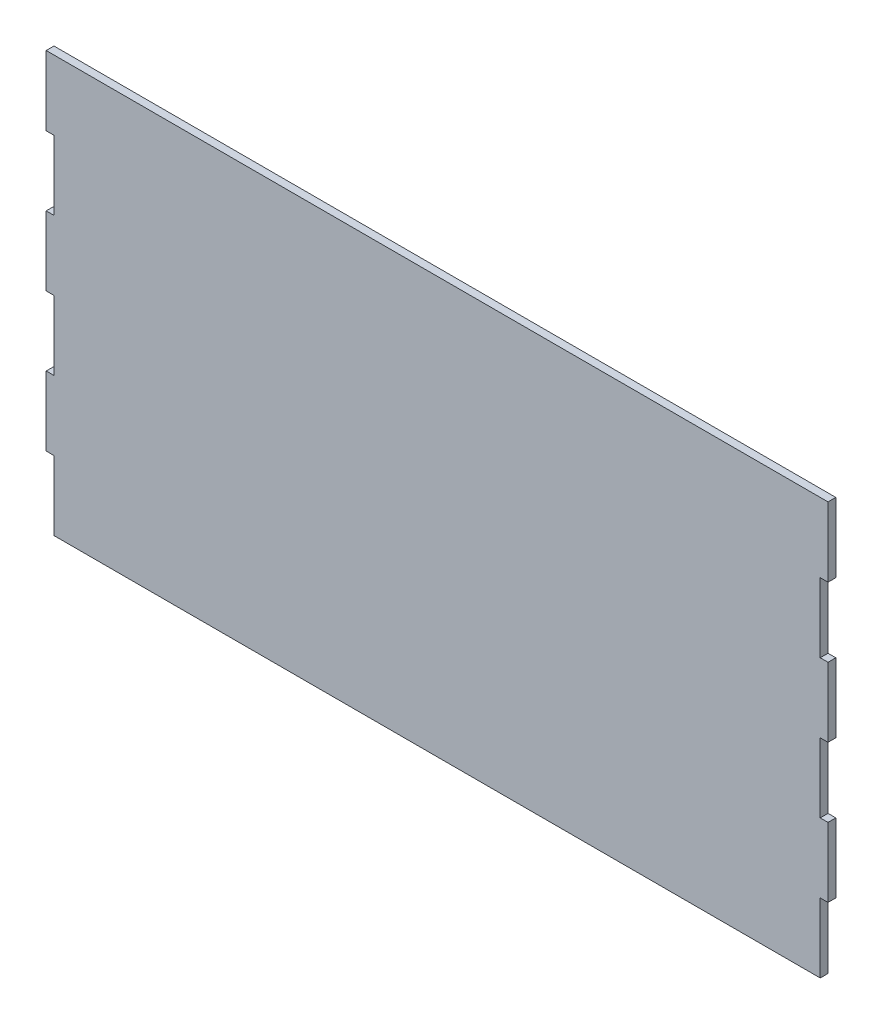
ISO-10303-21;
HEADER;
FILE_DESCRIPTION(('STEP AP214'),'2;1');
FILE_NAME('part.step','',(''),(''),'','','');
FILE_SCHEMA(('AUTOMOTIVE_DESIGN { 1 0 10303 214 1 1 1 1 }'));
ENDSEC;
DATA;
#1=APPLICATION_CONTEXT('core data for automotive mechanical design processes');
#2=APPLICATION_PROTOCOL_DEFINITION('international standard','automotive_design',2000,#1);
#3=PRODUCT_CONTEXT('',#1,'mechanical');
#4=PRODUCT('Part','Part','',(#3));
#5=PRODUCT_RELATED_PRODUCT_CATEGORY('part','',(#4));
#6=PRODUCT_DEFINITION_FORMATION('','',#4);
#7=PRODUCT_DEFINITION_CONTEXT('part definition',#1,'design');
#8=PRODUCT_DEFINITION('design','',#6,#7);
#9=PRODUCT_DEFINITION_SHAPE('','',#8);
#10=(LENGTH_UNIT() NAMED_UNIT(*) SI_UNIT(.MILLI.,.METRE.));
#11=(NAMED_UNIT(*) PLANE_ANGLE_UNIT() SI_UNIT($,.RADIAN.));
#12=(NAMED_UNIT(*) SI_UNIT($,.STERADIAN.) SOLID_ANGLE_UNIT());
#13=UNCERTAINTY_MEASURE_WITH_UNIT(LENGTH_MEASURE(1.E-05),#10,'distance_accuracy_value','');
#14=(GEOMETRIC_REPRESENTATION_CONTEXT(3) GLOBAL_UNCERTAINTY_ASSIGNED_CONTEXT((#13)) GLOBAL_UNIT_ASSIGNED_CONTEXT((#10,
#11,#12)) REPRESENTATION_CONTEXT('',''));
#15=CARTESIAN_POINT('',(0.,0.,0.));
#16=DIRECTION('',(0.,0.,1.));
#17=DIRECTION('',(1.,0.,0.));
#18=AXIS2_PLACEMENT_3D('',#15,#16,#17);
#19=CARTESIAN_POINT('',(-147.537163876748,3.44279027216279,3.));
#20=DIRECTION('',(1.,0.,0.));
#21=DIRECTION('',(0.,1.,0.));
#22=AXIS2_PLACEMENT_3D('',#19,#20,#21);
#23=PLANE('',#22);
#24=DIRECTION('',(0.,-1.,0.));
#25=VECTOR('',#24,1.);
#26=CARTESIAN_POINT('',(-147.537163876748,3.44279027216279,0.));
#27=LINE('',#26,#25);
#28=CARTESIAN_POINT('',(-147.537163876748,3.44279027216279,0.));
#29=VERTEX_POINT('',#28);
#30=CARTESIAN_POINT('',(-147.537163876748,-23.2572097278367,0.));
#31=VERTEX_POINT('',#30);
#32=EDGE_CURVE('E233',#29,#31,#27,.T.);
#33=ORIENTED_EDGE('',*,*,#32,.T.);
#34=DIRECTION('',(0.,0.,-1.));
#35=VECTOR('',#34,1.);
#36=CARTESIAN_POINT('',(-147.537163876748,-23.2572097278367,3.));
#37=LINE('',#36,#35);
#38=CARTESIAN_POINT('',(-147.537163876748,-23.2572097278367,3.));
#39=VERTEX_POINT('',#38);
#40=EDGE_CURVE('E11',#39,#31,#37,.T.);
#41=ORIENTED_EDGE('',*,*,#40,.F.);
#42=DIRECTION('',(0.,-1.,0.));
#43=VECTOR('',#42,1.);
#44=CARTESIAN_POINT('',(-147.537163876748,3.44279027216279,3.));
#45=LINE('',#44,#43);
#46=CARTESIAN_POINT('',(-147.537163876748,3.44279027216279,3.));
#47=VERTEX_POINT('',#46);
#48=EDGE_CURVE('E280',#47,#39,#45,.T.);
#49=ORIENTED_EDGE('',*,*,#48,.F.);
#50=DIRECTION('',(0.,0.,-1.));
#51=VECTOR('',#50,1.);
#52=CARTESIAN_POINT('',(-147.537163876748,3.44279027216279,3.));
#53=LINE('',#52,#51);
#54=EDGE_CURVE('E229',#47,#29,#53,.T.);
#55=ORIENTED_EDGE('',*,*,#54,.T.);
#56=EDGE_LOOP('',(#33,#41,#49,#55));
#57=FACE_BOUND('',#56,.T.);
#58=ADVANCED_FACE('F41',(#57),#23,.F.);
#59=CARTESIAN_POINT('',(-147.537163876748,-23.2572097278367,3.));
#60=DIRECTION('',(0.,1.,0.));
#61=DIRECTION('',(0.,0.,1.));
#62=AXIS2_PLACEMENT_3D('',#59,#60,#61);
#63=PLANE('',#62);
#64=DIRECTION('',(1.,0.,0.));
#65=VECTOR('',#64,1.);
#66=CARTESIAN_POINT('',(-147.537163876748,-23.2572097278367,0.));
#67=LINE('',#66,#65);
#68=CARTESIAN_POINT('',(147.537163876748,-23.2572097278367,0.));
#69=VERTEX_POINT('',#68);
#70=EDGE_CURVE('E236',#31,#69,#67,.T.);
#71=ORIENTED_EDGE('',*,*,#70,.T.);
#72=DIRECTION('',(0.,0.,-1.));
#73=VECTOR('',#72,1.);
#74=CARTESIAN_POINT('',(147.537163876748,-23.2572097278367,3.));
#75=LINE('',#74,#73);
#76=CARTESIAN_POINT('',(147.537163876748,-23.2572097278367,3.));
#77=VERTEX_POINT('',#76);
#78=EDGE_CURVE('E49',#77,#69,#75,.T.);
#79=ORIENTED_EDGE('',*,*,#78,.F.);
#80=DIRECTION('',(1.,0.,0.));
#81=VECTOR('',#80,1.);
#82=CARTESIAN_POINT('',(-147.537163876748,-23.2572097278367,3.));
#83=LINE('',#82,#81);
#84=EDGE_CURVE('E148',#39,#77,#83,.T.);
#85=ORIENTED_EDGE('',*,*,#84,.F.);
#86=ORIENTED_EDGE('',*,*,#40,.T.);
#87=EDGE_LOOP('',(#71,#79,#85,#86));
#88=FACE_BOUND('',#87,.T.);
#89=ADVANCED_FACE('F418',(#88),#63,.F.);
#90=CARTESIAN_POINT('',(147.537163876748,3.44279027216279,3.));
#91=DIRECTION('',(-1.,0.,0.));
#92=DIRECTION('',(0.,-1.,0.));
#93=AXIS2_PLACEMENT_3D('',#90,#91,#92);
#94=PLANE('',#93);
#95=DIRECTION('',(0.,1.,0.));
#96=VECTOR('',#95,1.);
#97=CARTESIAN_POINT('',(147.537163876748,3.44279027216279,0.));
#98=LINE('',#97,#96);
#99=CARTESIAN_POINT('',(147.537163876748,3.44279027216279,0.));
#100=VERTEX_POINT('',#99);
#101=EDGE_CURVE('E238',#69,#100,#98,.T.);
#102=ORIENTED_EDGE('',*,*,#101,.T.);
#103=DIRECTION('',(0.,0.,-1.));
#104=VECTOR('',#103,1.);
#105=CARTESIAN_POINT('',(147.537163876748,3.44279027216279,3.));
#106=LINE('',#105,#104);
#107=CARTESIAN_POINT('',(147.537163876748,3.44279027216279,3.));
#108=VERTEX_POINT('',#107);
#109=EDGE_CURVE('E335',#108,#100,#106,.T.);
#110=ORIENTED_EDGE('',*,*,#109,.F.);
#111=DIRECTION('',(0.,1.,0.));
#112=VECTOR('',#111,1.);
#113=CARTESIAN_POINT('',(147.537163876748,3.44279027216279,3.));
#114=LINE('',#113,#112);
#115=EDGE_CURVE('E343',#77,#108,#114,.T.);
#116=ORIENTED_EDGE('',*,*,#115,.F.);
#117=ORIENTED_EDGE('',*,*,#78,.T.);
#118=EDGE_LOOP('',(#102,#110,#116,#117));
#119=FACE_BOUND('',#118,.T.);
#120=ADVANCED_FACE('F341',(#119),#94,.F.);
#121=CARTESIAN_POINT('',(150.537163876748,3.44279027216279,3.));
#122=DIRECTION('',(0.,1.,0.));
#123=DIRECTION('',(0.,0.,1.));
#124=AXIS2_PLACEMENT_3D('',#121,#122,#123);
#125=PLANE('',#124);
#126=DIRECTION('',(1.,0.,0.));
#127=VECTOR('',#126,1.);
#128=CARTESIAN_POINT('',(150.537163876748,3.44279027216279,0.));
#129=LINE('',#128,#127);
#130=CARTESIAN_POINT('',(150.537163876748,3.44279027216279,0.));
#131=VERTEX_POINT('',#130);
#132=EDGE_CURVE('E240',#100,#131,#129,.T.);
#133=ORIENTED_EDGE('',*,*,#132,.T.);
#134=DIRECTION('',(0.,0.,-1.));
#135=VECTOR('',#134,1.);
#136=CARTESIAN_POINT('',(150.537163876748,3.44279027216279,3.));
#137=LINE('',#136,#135);
#138=CARTESIAN_POINT('',(150.537163876748,3.44279027216279,3.));
#139=VERTEX_POINT('',#138);
#140=EDGE_CURVE('E332',#139,#131,#137,.T.);
#141=ORIENTED_EDGE('',*,*,#140,.F.);
#142=DIRECTION('',(1.,0.,0.));
#143=VECTOR('',#142,1.);
#144=CARTESIAN_POINT('',(150.537163876748,3.44279027216279,3.));
#145=LINE('',#144,#143);
#146=EDGE_CURVE('E361',#108,#139,#145,.T.);
#147=ORIENTED_EDGE('',*,*,#146,.F.);
#148=ORIENTED_EDGE('',*,*,#109,.T.);
#149=EDGE_LOOP('',(#133,#141,#147,#148));
#150=FACE_BOUND('',#149,.T.);
#151=ADVANCED_FACE('F352',(#150),#125,.F.);
#152=CARTESIAN_POINT('',(150.537163876748,30.1427902721628,3.));
#153=DIRECTION('',(-1.,0.,0.));
#154=DIRECTION('',(0.,0.,1.));
#155=AXIS2_PLACEMENT_3D('',#152,#153,#154);
#156=PLANE('',#155);
#157=DIRECTION('',(0.,1.,0.));
#158=VECTOR('',#157,1.);
#159=CARTESIAN_POINT('',(150.537163876748,30.1427902721628,0.));
#160=LINE('',#159,#158);
#161=CARTESIAN_POINT('',(150.537163876748,30.1427902721628,0.));
#162=VERTEX_POINT('',#161);
#163=EDGE_CURVE('E242',#131,#162,#160,.T.);
#164=ORIENTED_EDGE('',*,*,#163,.T.);
#165=DIRECTION('',(0.,0.,-1.));
#166=VECTOR('',#165,1.);
#167=CARTESIAN_POINT('',(150.537163876748,30.1427902721628,3.));
#168=LINE('',#167,#166);
#169=CARTESIAN_POINT('',(150.537163876748,30.1427902721628,3.));
#170=VERTEX_POINT('',#169);
#171=EDGE_CURVE('E329',#170,#162,#168,.T.);
#172=ORIENTED_EDGE('',*,*,#171,.F.);
#173=DIRECTION('',(0.,1.,0.));
#174=VECTOR('',#173,1.);
#175=CARTESIAN_POINT('',(150.537163876748,30.1427902721628,3.));
#176=LINE('',#175,#174);
#177=EDGE_CURVE('E358',#139,#170,#176,.T.);
#178=ORIENTED_EDGE('',*,*,#177,.F.);
#179=ORIENTED_EDGE('',*,*,#140,.T.);
#180=EDGE_LOOP('',(#164,#172,#178,#179));
#181=FACE_BOUND('',#180,.T.);
#182=ADVANCED_FACE('F356',(#181),#156,.F.);
#183=CARTESIAN_POINT('',(147.537163876748,30.1427902721628,3.));
#184=DIRECTION('',(0.,-1.,0.));
#185=DIRECTION('',(0.,0.,-1.));
#186=AXIS2_PLACEMENT_3D('',#183,#184,#185);
#187=PLANE('',#186);
#188=DIRECTION('',(-1.,0.,0.));
#189=VECTOR('',#188,1.);
#190=CARTESIAN_POINT('',(147.537163876748,30.1427902721628,0.));
#191=LINE('',#190,#189);
#192=CARTESIAN_POINT('',(147.537163876748,30.1427902721628,0.));
#193=VERTEX_POINT('',#192);
#194=EDGE_CURVE('E244',#162,#193,#191,.T.);
#195=ORIENTED_EDGE('',*,*,#194,.T.);
#196=DIRECTION('',(0.,0.,-1.));
#197=VECTOR('',#196,1.);
#198=CARTESIAN_POINT('',(147.537163876748,30.1427902721628,3.));
#199=LINE('',#198,#197);
#200=CARTESIAN_POINT('',(147.537163876748,30.1427902721628,3.));
#201=VERTEX_POINT('',#200);
#202=EDGE_CURVE('E326',#201,#193,#199,.T.);
#203=ORIENTED_EDGE('',*,*,#202,.F.);
#204=DIRECTION('',(-1.,0.,0.));
#205=VECTOR('',#204,1.);
#206=CARTESIAN_POINT('',(147.537163876748,30.1427902721628,3.));
#207=LINE('',#206,#205);
#208=EDGE_CURVE('E360',#170,#201,#207,.T.);
#209=ORIENTED_EDGE('',*,*,#208,.F.);
#210=ORIENTED_EDGE('',*,*,#171,.T.);
#211=EDGE_LOOP('',(#195,#203,#209,#210));
#212=FACE_BOUND('',#211,.T.);
#213=ADVANCED_FACE('F431',(#212),#187,.F.);
#214=CARTESIAN_POINT('',(147.537163876748,56.8427902721628,3.));
#215=DIRECTION('',(-1.,0.,0.));
#216=DIRECTION('',(0.,0.,1.));
#217=AXIS2_PLACEMENT_3D('',#214,#215,#216);
#218=PLANE('',#217);
#219=DIRECTION('',(0.,1.,0.));
#220=VECTOR('',#219,1.);
#221=CARTESIAN_POINT('',(147.537163876748,56.8427902721628,0.));
#222=LINE('',#221,#220);
#223=CARTESIAN_POINT('',(147.537163876748,56.8427902721628,0.));
#224=VERTEX_POINT('',#223);
#225=EDGE_CURVE('E246',#193,#224,#222,.T.);
#226=ORIENTED_EDGE('',*,*,#225,.T.);
#227=DIRECTION('',(0.,0.,-1.));
#228=VECTOR('',#227,1.);
#229=CARTESIAN_POINT('',(147.537163876748,56.8427902721628,3.));
#230=LINE('',#229,#228);
#231=CARTESIAN_POINT('',(147.537163876748,56.8427902721628,3.));
#232=VERTEX_POINT('',#231);
#233=EDGE_CURVE('E323',#232,#224,#230,.T.);
#234=ORIENTED_EDGE('',*,*,#233,.F.);
#235=DIRECTION('',(0.,1.,0.));
#236=VECTOR('',#235,1.);
#237=CARTESIAN_POINT('',(147.537163876748,56.8427902721628,3.));
#238=LINE('',#237,#236);
#239=EDGE_CURVE('E363',#201,#232,#238,.T.);
#240=ORIENTED_EDGE('',*,*,#239,.F.);
#241=ORIENTED_EDGE('',*,*,#202,.T.);
#242=EDGE_LOOP('',(#226,#234,#240,#241));
#243=FACE_BOUND('',#242,.T.);
#244=ADVANCED_FACE('F434',(#243),#218,.F.);
#245=CARTESIAN_POINT('',(150.537163876748,56.8427902721628,3.));
#246=DIRECTION('',(0.,1.,0.));
#247=DIRECTION('',(0.,0.,1.));
#248=AXIS2_PLACEMENT_3D('',#245,#246,#247);
#249=PLANE('',#248);
#250=DIRECTION('',(1.,0.,0.));
#251=VECTOR('',#250,1.);
#252=CARTESIAN_POINT('',(150.537163876748,56.8427902721628,0.));
#253=LINE('',#252,#251);
#254=CARTESIAN_POINT('',(150.537163876748,56.8427902721628,0.));
#255=VERTEX_POINT('',#254);
#256=EDGE_CURVE('E248',#224,#255,#253,.T.);
#257=ORIENTED_EDGE('',*,*,#256,.T.);
#258=DIRECTION('',(0.,0.,-1.));
#259=VECTOR('',#258,1.);
#260=CARTESIAN_POINT('',(150.537163876748,56.8427902721628,3.));
#261=LINE('',#260,#259);
#262=CARTESIAN_POINT('',(150.537163876748,56.8427902721628,3.));
#263=VERTEX_POINT('',#262);
#264=EDGE_CURVE('E320',#263,#255,#261,.T.);
#265=ORIENTED_EDGE('',*,*,#264,.F.);
#266=DIRECTION('',(1.,0.,0.));
#267=VECTOR('',#266,1.);
#268=CARTESIAN_POINT('',(150.537163876748,56.8427902721628,3.));
#269=LINE('',#268,#267);
#270=EDGE_CURVE('E369',#232,#263,#269,.T.);
#271=ORIENTED_EDGE('',*,*,#270,.F.);
#272=ORIENTED_EDGE('',*,*,#233,.T.);
#273=EDGE_LOOP('',(#257,#265,#271,#272));
#274=FACE_BOUND('',#273,.T.);
#275=ADVANCED_FACE('F438',(#274),#249,.F.);
#276=CARTESIAN_POINT('',(150.537163876748,83.5427902721628,3.));
#277=DIRECTION('',(-1.,0.,0.));
#278=DIRECTION('',(0.,0.,1.));
#279=AXIS2_PLACEMENT_3D('',#276,#277,#278);
#280=PLANE('',#279);
#281=DIRECTION('',(0.,1.,0.));
#282=VECTOR('',#281,1.);
#283=CARTESIAN_POINT('',(150.537163876748,83.5427902721628,0.));
#284=LINE('',#283,#282);
#285=CARTESIAN_POINT('',(150.537163876748,83.5427902721628,0.));
#286=VERTEX_POINT('',#285);
#287=EDGE_CURVE('E250',#255,#286,#284,.T.);
#288=ORIENTED_EDGE('',*,*,#287,.T.);
#289=DIRECTION('',(0.,0.,-1.));
#290=VECTOR('',#289,1.);
#291=CARTESIAN_POINT('',(150.537163876748,83.5427902721628,3.));
#292=LINE('',#291,#290);
#293=CARTESIAN_POINT('',(150.537163876748,83.5427902721628,3.));
#294=VERTEX_POINT('',#293);
#295=EDGE_CURVE('E317',#294,#286,#292,.T.);
#296=ORIENTED_EDGE('',*,*,#295,.F.);
#297=DIRECTION('',(0.,1.,0.));
#298=VECTOR('',#297,1.);
#299=CARTESIAN_POINT('',(150.537163876748,83.5427902721628,3.));
#300=LINE('',#299,#298);
#301=EDGE_CURVE('E371',#263,#294,#300,.T.);
#302=ORIENTED_EDGE('',*,*,#301,.F.);
#303=ORIENTED_EDGE('',*,*,#264,.T.);
#304=EDGE_LOOP('',(#288,#296,#302,#303));
#305=FACE_BOUND('',#304,.T.);
#306=ADVANCED_FACE('F442',(#305),#280,.F.);
#307=CARTESIAN_POINT('',(147.537163876748,83.5427902721628,3.));
#308=DIRECTION('',(0.,-1.,0.));
#309=DIRECTION('',(0.,0.,-1.));
#310=AXIS2_PLACEMENT_3D('',#307,#308,#309);
#311=PLANE('',#310);
#312=DIRECTION('',(-1.,0.,0.));
#313=VECTOR('',#312,1.);
#314=CARTESIAN_POINT('',(147.537163876748,83.5427902721628,0.));
#315=LINE('',#314,#313);
#316=CARTESIAN_POINT('',(147.537163876748,83.5427902721628,0.));
#317=VERTEX_POINT('',#316);
#318=EDGE_CURVE('E252',#286,#317,#315,.T.);
#319=ORIENTED_EDGE('',*,*,#318,.T.);
#320=DIRECTION('',(0.,0.,-1.));
#321=VECTOR('',#320,1.);
#322=CARTESIAN_POINT('',(147.537163876748,83.5427902721628,3.));
#323=LINE('',#322,#321);
#324=CARTESIAN_POINT('',(147.537163876748,83.5427902721628,3.));
#325=VERTEX_POINT('',#324);
#326=EDGE_CURVE('E314',#325,#317,#323,.T.);
#327=ORIENTED_EDGE('',*,*,#326,.F.);
#328=DIRECTION('',(-1.,0.,0.));
#329=VECTOR('',#328,1.);
#330=CARTESIAN_POINT('',(147.537163876748,83.5427902721628,3.));
#331=LINE('',#330,#329);
#332=EDGE_CURVE('E373',#294,#325,#331,.T.);
#333=ORIENTED_EDGE('',*,*,#332,.F.);
#334=ORIENTED_EDGE('',*,*,#295,.T.);
#335=EDGE_LOOP('',(#319,#327,#333,#334));
#336=FACE_BOUND('',#335,.T.);
#337=ADVANCED_FACE('F446',(#336),#311,.F.);
#338=CARTESIAN_POINT('',(147.537163876748,110.242790272163,3.));
#339=DIRECTION('',(-1.,0.,0.));
#340=DIRECTION('',(0.,0.,1.));
#341=AXIS2_PLACEMENT_3D('',#338,#339,#340);
#342=PLANE('',#341);
#343=DIRECTION('',(0.,1.,0.));
#344=VECTOR('',#343,1.);
#345=CARTESIAN_POINT('',(147.537163876748,110.242790272163,0.));
#346=LINE('',#345,#344);
#347=CARTESIAN_POINT('',(147.537163876748,110.242790272163,0.));
#348=VERTEX_POINT('',#347);
#349=EDGE_CURVE('E254',#317,#348,#346,.T.);
#350=ORIENTED_EDGE('',*,*,#349,.T.);
#351=DIRECTION('',(0.,0.,-1.));
#352=VECTOR('',#351,1.);
#353=CARTESIAN_POINT('',(147.537163876748,110.242790272163,3.));
#354=LINE('',#353,#352);
#355=CARTESIAN_POINT('',(147.537163876748,110.242790272163,3.));
#356=VERTEX_POINT('',#355);
#357=EDGE_CURVE('E311',#356,#348,#354,.T.);
#358=ORIENTED_EDGE('',*,*,#357,.F.);
#359=DIRECTION('',(0.,1.,0.));
#360=VECTOR('',#359,1.);
#361=CARTESIAN_POINT('',(147.537163876748,110.242790272163,3.));
#362=LINE('',#361,#360);
#363=EDGE_CURVE('E375',#325,#356,#362,.T.);
#364=ORIENTED_EDGE('',*,*,#363,.F.);
#365=ORIENTED_EDGE('',*,*,#326,.T.);
#366=EDGE_LOOP('',(#350,#358,#364,#365));
#367=FACE_BOUND('',#366,.T.);
#368=ADVANCED_FACE('F450',(#367),#342,.F.);
#369=CARTESIAN_POINT('',(150.537163876748,110.242790272163,3.));
#370=DIRECTION('',(0.,1.,0.));
#371=DIRECTION('',(-1.,0.,0.));
#372=AXIS2_PLACEMENT_3D('',#369,#370,#371);
#373=PLANE('',#372);
#374=DIRECTION('',(1.,0.,0.));
#375=VECTOR('',#374,1.);
#376=CARTESIAN_POINT('',(150.537163876748,110.242790272163,0.));
#377=LINE('',#376,#375);
#378=CARTESIAN_POINT('',(150.537163876748,110.242790272163,0.));
#379=VERTEX_POINT('',#378);
#380=EDGE_CURVE('E256',#348,#379,#377,.T.);
#381=ORIENTED_EDGE('',*,*,#380,.T.);
#382=DIRECTION('',(0.,0.,-1.));
#383=VECTOR('',#382,1.);
#384=CARTESIAN_POINT('',(150.537163876748,110.242790272163,3.));
#385=LINE('',#384,#383);
#386=CARTESIAN_POINT('',(150.537163876748,110.242790272163,3.));
#387=VERTEX_POINT('',#386);
#388=EDGE_CURVE('E308',#387,#379,#385,.T.);
#389=ORIENTED_EDGE('',*,*,#388,.F.);
#390=DIRECTION('',(1.,0.,0.));
#391=VECTOR('',#390,1.);
#392=CARTESIAN_POINT('',(150.537163876748,110.242790272163,3.));
#393=LINE('',#392,#391);
#394=EDGE_CURVE('E377',#356,#387,#393,.T.);
#395=ORIENTED_EDGE('',*,*,#394,.F.);
#396=ORIENTED_EDGE('',*,*,#357,.T.);
#397=EDGE_LOOP('',(#381,#389,#395,#396));
#398=FACE_BOUND('',#397,.T.);
#399=ADVANCED_FACE('F454',(#398),#373,.F.);
#400=CARTESIAN_POINT('',(150.537163876748,137.021276107109,3.));
#401=DIRECTION('',(-1.,0.,0.));
#402=DIRECTION('',(0.,-1.,0.));
#403=AXIS2_PLACEMENT_3D('',#400,#401,#402);
#404=PLANE('',#403);
#405=DIRECTION('',(0.,1.,0.));
#406=VECTOR('',#405,1.);
#407=CARTESIAN_POINT('',(150.537163876748,137.021276107109,0.));
#408=LINE('',#407,#406);
#409=CARTESIAN_POINT('',(150.537163876748,137.021276107109,0.));
#410=VERTEX_POINT('',#409);
#411=EDGE_CURVE('E258',#379,#410,#408,.T.);
#412=ORIENTED_EDGE('',*,*,#411,.T.);
#413=DIRECTION('',(0.,0.,-1.));
#414=VECTOR('',#413,1.);
#415=CARTESIAN_POINT('',(150.537163876748,137.021276107109,3.));
#416=LINE('',#415,#414);
#417=CARTESIAN_POINT('',(150.537163876748,137.021276107109,3.));
#418=VERTEX_POINT('',#417);
#419=EDGE_CURVE('E305',#418,#410,#416,.T.);
#420=ORIENTED_EDGE('',*,*,#419,.F.);
#421=DIRECTION('',(0.,1.,0.));
#422=VECTOR('',#421,1.);
#423=CARTESIAN_POINT('',(150.537163876748,137.021276107109,3.));
#424=LINE('',#423,#422);
#425=EDGE_CURVE('E379',#387,#418,#424,.T.);
#426=ORIENTED_EDGE('',*,*,#425,.F.);
#427=ORIENTED_EDGE('',*,*,#388,.T.);
#428=EDGE_LOOP('',(#412,#420,#426,#427));
#429=FACE_BOUND('',#428,.T.);
#430=ADVANCED_FACE('F458',(#429),#404,.F.);
#431=CARTESIAN_POINT('',(-150.537163876748,137.021276107109,3.));
#432=DIRECTION('',(0.,-1.,0.));
#433=DIRECTION('',(0.,0.,-1.));
#434=AXIS2_PLACEMENT_3D('',#431,#432,#433);
#435=PLANE('',#434);
#436=DIRECTION('',(-1.,0.,0.));
#437=VECTOR('',#436,1.);
#438=CARTESIAN_POINT('',(-150.537163876748,137.021276107109,0.));
#439=LINE('',#438,#437);
#440=CARTESIAN_POINT('',(-150.537163876748,137.021276107109,0.));
#441=VERTEX_POINT('',#440);
#442=EDGE_CURVE('E261',#410,#441,#439,.T.);
#443=ORIENTED_EDGE('',*,*,#442,.T.);
#444=DIRECTION('',(0.,0.,-1.));
#445=VECTOR('',#444,1.);
#446=CARTESIAN_POINT('',(-150.537163876748,137.021276107109,3.));
#447=LINE('',#446,#445);
#448=CARTESIAN_POINT('',(-150.537163876748,137.021276107109,3.));
#449=VERTEX_POINT('',#448);
#450=EDGE_CURVE('E302',#449,#441,#447,.T.);
#451=ORIENTED_EDGE('',*,*,#450,.F.);
#452=DIRECTION('',(-1.,0.,0.));
#453=VECTOR('',#452,1.);
#454=CARTESIAN_POINT('',(150.537163876748,137.021276107109,3.));
#455=LINE('',#454,#453);
#456=EDGE_CURVE('E381',#418,#449,#455,.T.);
#457=ORIENTED_EDGE('',*,*,#456,.F.);
#458=ORIENTED_EDGE('',*,*,#419,.T.);
#459=EDGE_LOOP('',(#443,#451,#457,#458));
#460=FACE_BOUND('',#459,.T.);
#461=ADVANCED_FACE('F462',(#460),#435,.F.);
#462=CARTESIAN_POINT('',(-150.537163876748,137.021276107109,3.));
#463=DIRECTION('',(1.,0.,0.));
#464=DIRECTION('',(0.,1.,0.));
#465=AXIS2_PLACEMENT_3D('',#462,#463,#464);
#466=PLANE('',#465);
#467=DIRECTION('',(0.,-1.,0.));
#468=VECTOR('',#467,1.);
#469=CARTESIAN_POINT('',(-150.537163876748,137.021276107109,0.));
#470=LINE('',#469,#468);
#471=CARTESIAN_POINT('',(-150.537163876748,110.242790272163,0.));
#472=VERTEX_POINT('',#471);
#473=EDGE_CURVE('E263',#441,#472,#470,.T.);
#474=ORIENTED_EDGE('',*,*,#473,.T.);
#475=DIRECTION('',(0.,0.,-1.));
#476=VECTOR('',#475,1.);
#477=CARTESIAN_POINT('',(-150.537163876748,110.242790272163,3.));
#478=LINE('',#477,#476);
#479=CARTESIAN_POINT('',(-150.537163876748,110.242790272163,3.));
#480=VERTEX_POINT('',#479);
#481=EDGE_CURVE('E299',#480,#472,#478,.T.);
#482=ORIENTED_EDGE('',*,*,#481,.F.);
#483=DIRECTION('',(0.,-1.,0.));
#484=VECTOR('',#483,1.);
#485=CARTESIAN_POINT('',(-150.537163876748,137.021276107109,3.));
#486=LINE('',#485,#484);
#487=EDGE_CURVE('E383',#449,#480,#486,.T.);
#488=ORIENTED_EDGE('',*,*,#487,.F.);
#489=ORIENTED_EDGE('',*,*,#450,.T.);
#490=EDGE_LOOP('',(#474,#482,#488,#489));
#491=FACE_BOUND('',#490,.T.);
#492=ADVANCED_FACE('F466',(#491),#466,.F.);
#493=CARTESIAN_POINT('',(-150.537163876748,110.242790272163,3.));
#494=DIRECTION('',(0.,1.,0.));
#495=DIRECTION('',(-1.,0.,0.));
#496=AXIS2_PLACEMENT_3D('',#493,#494,#495);
#497=PLANE('',#496);
#498=DIRECTION('',(1.,0.,0.));
#499=VECTOR('',#498,1.);
#500=CARTESIAN_POINT('',(-150.537163876748,110.242790272163,0.));
#501=LINE('',#500,#499);
#502=CARTESIAN_POINT('',(-147.537163876748,110.242790272163,0.));
#503=VERTEX_POINT('',#502);
#504=EDGE_CURVE('E265',#472,#503,#501,.T.);
#505=ORIENTED_EDGE('',*,*,#504,.T.);
#506=DIRECTION('',(0.,0.,-1.));
#507=VECTOR('',#506,1.);
#508=CARTESIAN_POINT('',(-147.537163876748,110.242790272163,3.));
#509=LINE('',#508,#507);
#510=CARTESIAN_POINT('',(-147.537163876748,110.242790272163,3.));
#511=VERTEX_POINT('',#510);
#512=EDGE_CURVE('E296',#511,#503,#509,.T.);
#513=ORIENTED_EDGE('',*,*,#512,.F.);
#514=DIRECTION('',(1.,0.,0.));
#515=VECTOR('',#514,1.);
#516=CARTESIAN_POINT('',(-150.537163876748,110.242790272163,3.));
#517=LINE('',#516,#515);
#518=EDGE_CURVE('E385',#480,#511,#517,.T.);
#519=ORIENTED_EDGE('',*,*,#518,.F.);
#520=ORIENTED_EDGE('',*,*,#481,.T.);
#521=EDGE_LOOP('',(#505,#513,#519,#520));
#522=FACE_BOUND('',#521,.T.);
#523=ADVANCED_FACE('F470',(#522),#497,.F.);
#524=CARTESIAN_POINT('',(-147.537163876748,110.242790272163,3.));
#525=DIRECTION('',(1.,0.,0.));
#526=DIRECTION('',(0.,0.,-1.));
#527=AXIS2_PLACEMENT_3D('',#524,#525,#526);
#528=PLANE('',#527);
#529=DIRECTION('',(0.,-1.,0.));
#530=VECTOR('',#529,1.);
#531=CARTESIAN_POINT('',(-147.537163876748,110.242790272163,0.));
#532=LINE('',#531,#530);
#533=CARTESIAN_POINT('',(-147.537163876748,83.5427902721628,0.));
#534=VERTEX_POINT('',#533);
#535=EDGE_CURVE('E267',#503,#534,#532,.T.);
#536=ORIENTED_EDGE('',*,*,#535,.T.);
#537=DIRECTION('',(0.,0.,-1.));
#538=VECTOR('',#537,1.);
#539=CARTESIAN_POINT('',(-147.537163876748,83.5427902721628,3.));
#540=LINE('',#539,#538);
#541=CARTESIAN_POINT('',(-147.537163876748,83.5427902721628,3.));
#542=VERTEX_POINT('',#541);
#543=EDGE_CURVE('E293',#542,#534,#540,.T.);
#544=ORIENTED_EDGE('',*,*,#543,.F.);
#545=DIRECTION('',(0.,-1.,0.));
#546=VECTOR('',#545,1.);
#547=CARTESIAN_POINT('',(-147.537163876748,110.242790272163,3.));
#548=LINE('',#547,#546);
#549=EDGE_CURVE('E387',#511,#542,#548,.T.);
#550=ORIENTED_EDGE('',*,*,#549,.F.);
#551=ORIENTED_EDGE('',*,*,#512,.T.);
#552=EDGE_LOOP('',(#536,#544,#550,#551));
#553=FACE_BOUND('',#552,.T.);
#554=ADVANCED_FACE('F474',(#553),#528,.F.);
#555=CARTESIAN_POINT('',(-147.537163876748,83.5427902721628,3.));
#556=DIRECTION('',(0.,-1.,0.));
#557=DIRECTION('',(0.,0.,-1.));
#558=AXIS2_PLACEMENT_3D('',#555,#556,#557);
#559=PLANE('',#558);
#560=DIRECTION('',(-1.,0.,0.));
#561=VECTOR('',#560,1.);
#562=CARTESIAN_POINT('',(-147.537163876748,83.5427902721628,0.));
#563=LINE('',#562,#561);
#564=CARTESIAN_POINT('',(-150.537163876748,83.5427902721628,0.));
#565=VERTEX_POINT('',#564);
#566=EDGE_CURVE('E269',#534,#565,#563,.T.);
#567=ORIENTED_EDGE('',*,*,#566,.T.);
#568=DIRECTION('',(0.,0.,-1.));
#569=VECTOR('',#568,1.);
#570=CARTESIAN_POINT('',(-150.537163876748,83.5427902721628,3.));
#571=LINE('',#570,#569);
#572=CARTESIAN_POINT('',(-150.537163876748,83.5427902721628,3.));
#573=VERTEX_POINT('',#572);
#574=EDGE_CURVE('E290',#573,#565,#571,.T.);
#575=ORIENTED_EDGE('',*,*,#574,.F.);
#576=DIRECTION('',(-1.,0.,0.));
#577=VECTOR('',#576,1.);
#578=CARTESIAN_POINT('',(-147.537163876748,83.5427902721628,3.));
#579=LINE('',#578,#577);
#580=EDGE_CURVE('E389',#542,#573,#579,.T.);
#581=ORIENTED_EDGE('',*,*,#580,.F.);
#582=ORIENTED_EDGE('',*,*,#543,.T.);
#583=EDGE_LOOP('',(#567,#575,#581,#582));
#584=FACE_BOUND('',#583,.T.);
#585=ADVANCED_FACE('F478',(#584),#559,.F.);
#586=CARTESIAN_POINT('',(-150.537163876748,83.5427902721628,3.));
#587=DIRECTION('',(1.,0.,0.));
#588=DIRECTION('',(0.,0.,-1.));
#589=AXIS2_PLACEMENT_3D('',#586,#587,#588);
#590=PLANE('',#589);
#591=DIRECTION('',(0.,-1.,0.));
#592=VECTOR('',#591,1.);
#593=CARTESIAN_POINT('',(-150.537163876748,83.5427902721628,0.));
#594=LINE('',#593,#592);
#595=CARTESIAN_POINT('',(-150.537163876748,56.8427902721628,0.));
#596=VERTEX_POINT('',#595);
#597=EDGE_CURVE('E271',#565,#596,#594,.T.);
#598=ORIENTED_EDGE('',*,*,#597,.T.);
#599=DIRECTION('',(0.,0.,-1.));
#600=VECTOR('',#599,1.);
#601=CARTESIAN_POINT('',(-150.537163876748,56.8427902721628,3.));
#602=LINE('',#601,#600);
#603=CARTESIAN_POINT('',(-150.537163876748,56.8427902721628,3.));
#604=VERTEX_POINT('',#603);
#605=EDGE_CURVE('E287',#604,#596,#602,.T.);
#606=ORIENTED_EDGE('',*,*,#605,.F.);
#607=DIRECTION('',(0.,-1.,0.));
#608=VECTOR('',#607,1.);
#609=CARTESIAN_POINT('',(-150.537163876748,83.5427902721628,3.));
#610=LINE('',#609,#608);
#611=EDGE_CURVE('E391',#573,#604,#610,.T.);
#612=ORIENTED_EDGE('',*,*,#611,.F.);
#613=ORIENTED_EDGE('',*,*,#574,.T.);
#614=EDGE_LOOP('',(#598,#606,#612,#613));
#615=FACE_BOUND('',#614,.T.);
#616=ADVANCED_FACE('F482',(#615),#590,.F.);
#617=CARTESIAN_POINT('',(-150.537163876748,56.8427902721628,3.));
#618=DIRECTION('',(0.,1.,0.));
#619=DIRECTION('',(0.,0.,1.));
#620=AXIS2_PLACEMENT_3D('',#617,#618,#619);
#621=PLANE('',#620);
#622=DIRECTION('',(1.,0.,0.));
#623=VECTOR('',#622,1.);
#624=CARTESIAN_POINT('',(-150.537163876748,56.8427902721628,0.));
#625=LINE('',#624,#623);
#626=CARTESIAN_POINT('',(-147.537163876748,56.8427902721628,0.));
#627=VERTEX_POINT('',#626);
#628=EDGE_CURVE('E273',#596,#627,#625,.T.);
#629=ORIENTED_EDGE('',*,*,#628,.T.);
#630=DIRECTION('',(0.,0.,-1.));
#631=VECTOR('',#630,1.);
#632=CARTESIAN_POINT('',(-147.537163876748,56.8427902721628,3.));
#633=LINE('',#632,#631);
#634=CARTESIAN_POINT('',(-147.537163876748,56.8427902721628,3.));
#635=VERTEX_POINT('',#634);
#636=EDGE_CURVE('E284',#635,#627,#633,.T.);
#637=ORIENTED_EDGE('',*,*,#636,.F.);
#638=DIRECTION('',(1.,0.,0.));
#639=VECTOR('',#638,1.);
#640=CARTESIAN_POINT('',(-150.537163876748,56.8427902721628,3.));
#641=LINE('',#640,#639);
#642=EDGE_CURVE('E393',#604,#635,#641,.T.);
#643=ORIENTED_EDGE('',*,*,#642,.F.);
#644=ORIENTED_EDGE('',*,*,#605,.T.);
#645=EDGE_LOOP('',(#629,#637,#643,#644));
#646=FACE_BOUND('',#645,.T.);
#647=ADVANCED_FACE('F399',(#646),#621,.F.);
#648=CARTESIAN_POINT('',(-147.537163876748,56.8427902721628,3.));
#649=DIRECTION('',(1.,0.,0.));
#650=DIRECTION('',(0.,0.,-1.));
#651=AXIS2_PLACEMENT_3D('',#648,#649,#650);
#652=PLANE('',#651);
#653=DIRECTION('',(0.,-1.,0.));
#654=VECTOR('',#653,1.);
#655=CARTESIAN_POINT('',(-147.537163876748,56.8427902721628,0.));
#656=LINE('',#655,#654);
#657=CARTESIAN_POINT('',(-147.537163876748,30.1427902721628,0.));
#658=VERTEX_POINT('',#657);
#659=EDGE_CURVE('E275',#627,#658,#656,.T.);
#660=ORIENTED_EDGE('',*,*,#659,.T.);
#661=DIRECTION('',(0.,0.,-1.));
#662=VECTOR('',#661,1.);
#663=CARTESIAN_POINT('',(-147.537163876748,30.1427902721628,3.));
#664=LINE('',#663,#662);
#665=CARTESIAN_POINT('',(-147.537163876748,30.1427902721628,3.));
#666=VERTEX_POINT('',#665);
#667=EDGE_CURVE('E224',#666,#658,#664,.T.);
#668=ORIENTED_EDGE('',*,*,#667,.F.);
#669=DIRECTION('',(0.,-1.,0.));
#670=VECTOR('',#669,1.);
#671=CARTESIAN_POINT('',(-147.537163876748,56.8427902721628,3.));
#672=LINE('',#671,#670);
#673=EDGE_CURVE('E215',#635,#666,#672,.T.);
#674=ORIENTED_EDGE('',*,*,#673,.F.);
#675=ORIENTED_EDGE('',*,*,#636,.T.);
#676=EDGE_LOOP('',(#660,#668,#674,#675));
#677=FACE_BOUND('',#676,.T.);
#678=ADVANCED_FACE('F403',(#677),#652,.F.);
#679=CARTESIAN_POINT('',(-147.537163876748,30.1427902721628,3.));
#680=DIRECTION('',(0.,-1.,0.));
#681=DIRECTION('',(0.,0.,-1.));
#682=AXIS2_PLACEMENT_3D('',#679,#680,#681);
#683=PLANE('',#682);
#684=DIRECTION('',(-1.,0.,0.));
#685=VECTOR('',#684,1.);
#686=CARTESIAN_POINT('',(-147.537163876748,30.1427902721628,0.));
#687=LINE('',#686,#685);
#688=CARTESIAN_POINT('',(-150.537163876748,30.1427902721628,0.));
#689=VERTEX_POINT('',#688);
#690=EDGE_CURVE('E223',#658,#689,#687,.T.);
#691=ORIENTED_EDGE('',*,*,#690,.T.);
#692=DIRECTION('',(0.,0.,-1.));
#693=VECTOR('',#692,1.);
#694=CARTESIAN_POINT('',(-150.537163876748,30.1427902721628,3.));
#695=LINE('',#694,#693);
#696=CARTESIAN_POINT('',(-150.537163876748,30.1427902721628,3.));
#697=VERTEX_POINT('',#696);
#698=EDGE_CURVE('E220',#697,#689,#695,.T.);
#699=ORIENTED_EDGE('',*,*,#698,.F.);
#700=DIRECTION('',(-1.,0.,0.));
#701=VECTOR('',#700,1.);
#702=CARTESIAN_POINT('',(-147.537163876748,30.1427902721628,3.));
#703=LINE('',#702,#701);
#704=EDGE_CURVE('E209',#666,#697,#703,.T.);
#705=ORIENTED_EDGE('',*,*,#704,.F.);
#706=ORIENTED_EDGE('',*,*,#667,.T.);
#707=EDGE_LOOP('',(#691,#699,#705,#706));
#708=FACE_BOUND('',#707,.T.);
#709=ADVANCED_FACE('F221',(#708),#683,.F.);
#710=CARTESIAN_POINT('',(-150.537163876748,30.1427902721628,3.));
#711=DIRECTION('',(1.,0.,0.));
#712=DIRECTION('',(0.,0.,-1.));
#713=AXIS2_PLACEMENT_3D('',#710,#711,#712);
#714=PLANE('',#713);
#715=DIRECTION('',(0.,-1.,0.));
#716=VECTOR('',#715,1.);
#717=CARTESIAN_POINT('',(-150.537163876748,30.1427902721628,0.));
#718=LINE('',#717,#716);
#719=CARTESIAN_POINT('',(-150.537163876748,3.44279027216279,0.));
#720=VERTEX_POINT('',#719);
#721=EDGE_CURVE('E134',#689,#720,#718,.T.);
#722=ORIENTED_EDGE('',*,*,#721,.T.);
#723=DIRECTION('',(0.,0.,-1.));
#724=VECTOR('',#723,1.);
#725=CARTESIAN_POINT('',(-150.537163876748,3.44279027216279,3.));
#726=LINE('',#725,#724);
#727=CARTESIAN_POINT('',(-150.537163876748,3.44279027216279,3.));
#728=VERTEX_POINT('',#727);
#729=EDGE_CURVE('E225',#728,#720,#726,.T.);
#730=ORIENTED_EDGE('',*,*,#729,.F.);
#731=DIRECTION('',(0.,-1.,0.));
#732=VECTOR('',#731,1.);
#733=CARTESIAN_POINT('',(-150.537163876748,30.1427902721628,3.));
#734=LINE('',#733,#732);
#735=EDGE_CURVE('E213',#697,#728,#734,.T.);
#736=ORIENTED_EDGE('',*,*,#735,.F.);
#737=ORIENTED_EDGE('',*,*,#698,.T.);
#738=EDGE_LOOP('',(#722,#730,#736,#737));
#739=FACE_BOUND('',#738,.T.);
#740=ADVANCED_FACE('F227',(#739),#714,.F.);
#741=CARTESIAN_POINT('',(-150.537163876748,3.44279027216279,3.));
#742=DIRECTION('',(0.,1.,0.));
#743=DIRECTION('',(0.,0.,1.));
#744=AXIS2_PLACEMENT_3D('',#741,#742,#743);
#745=PLANE('',#744);
#746=DIRECTION('',(1.,0.,0.));
#747=VECTOR('',#746,1.);
#748=CARTESIAN_POINT('',(-150.537163876748,3.44279027216279,0.));
#749=LINE('',#748,#747);
#750=EDGE_CURVE('E140',#720,#29,#749,.T.);
#751=ORIENTED_EDGE('',*,*,#750,.T.);
#752=ORIENTED_EDGE('',*,*,#54,.F.);
#753=DIRECTION('',(1.,0.,0.));
#754=VECTOR('',#753,1.);
#755=CARTESIAN_POINT('',(-150.537163876748,3.44279027216279,3.));
#756=LINE('',#755,#754);
#757=EDGE_CURVE('E57',#728,#47,#756,.T.);
#758=ORIENTED_EDGE('',*,*,#757,.F.);
#759=ORIENTED_EDGE('',*,*,#729,.T.);
#760=EDGE_LOOP('',(#751,#752,#758,#759));
#761=FACE_BOUND('',#760,.T.);
#762=ADVANCED_FACE('F407',(#761),#745,.F.);
#763=CARTESIAN_POINT('',(0.,0.,3.));
#764=DIRECTION('',(0.,0.,1.));
#765=DIRECTION('',(1.,0.,0.));
#766=AXIS2_PLACEMENT_3D('',#763,#764,#765);
#767=PLANE('',#766);
#768=ORIENTED_EDGE('',*,*,#48,.T.);
#769=ORIENTED_EDGE('',*,*,#84,.T.);
#770=ORIENTED_EDGE('',*,*,#115,.T.);
#771=ORIENTED_EDGE('',*,*,#146,.T.);
#772=ORIENTED_EDGE('',*,*,#177,.T.);
#773=ORIENTED_EDGE('',*,*,#208,.T.);
#774=ORIENTED_EDGE('',*,*,#239,.T.);
#775=ORIENTED_EDGE('',*,*,#270,.T.);
#776=ORIENTED_EDGE('',*,*,#301,.T.);
#777=ORIENTED_EDGE('',*,*,#332,.T.);
#778=ORIENTED_EDGE('',*,*,#363,.T.);
#779=ORIENTED_EDGE('',*,*,#394,.T.);
#780=ORIENTED_EDGE('',*,*,#425,.T.);
#781=ORIENTED_EDGE('',*,*,#456,.T.);
#782=ORIENTED_EDGE('',*,*,#487,.T.);
#783=ORIENTED_EDGE('',*,*,#518,.T.);
#784=ORIENTED_EDGE('',*,*,#549,.T.);
#785=ORIENTED_EDGE('',*,*,#580,.T.);
#786=ORIENTED_EDGE('',*,*,#611,.T.);
#787=ORIENTED_EDGE('',*,*,#642,.T.);
#788=ORIENTED_EDGE('',*,*,#673,.T.);
#789=ORIENTED_EDGE('',*,*,#704,.T.);
#790=ORIENTED_EDGE('',*,*,#735,.T.);
#791=ORIENTED_EDGE('',*,*,#757,.T.);
#792=EDGE_LOOP('',(#768,#769,#770,#771,#772,#773,#774,#775,#776,#777,#778,#779,#780,#781,#782,
#783,#784,#785,#786,#787,#788,#789,#790,#791));
#793=FACE_BOUND('',#792,.T.);
#794=ADVANCED_FACE('F211',(#793),#767,.T.);
#795=CARTESIAN_POINT('',(0.,0.,0.));
#796=DIRECTION('',(0.,0.,1.));
#797=DIRECTION('',(1.,0.,0.));
#798=AXIS2_PLACEMENT_3D('',#795,#796,#797);
#799=PLANE('',#798);
#800=ORIENTED_EDGE('',*,*,#32,.F.);
#801=ORIENTED_EDGE('',*,*,#750,.F.);
#802=ORIENTED_EDGE('',*,*,#721,.F.);
#803=ORIENTED_EDGE('',*,*,#690,.F.);
#804=ORIENTED_EDGE('',*,*,#659,.F.);
#805=ORIENTED_EDGE('',*,*,#628,.F.);
#806=ORIENTED_EDGE('',*,*,#597,.F.);
#807=ORIENTED_EDGE('',*,*,#566,.F.);
#808=ORIENTED_EDGE('',*,*,#535,.F.);
#809=ORIENTED_EDGE('',*,*,#504,.F.);
#810=ORIENTED_EDGE('',*,*,#473,.F.);
#811=ORIENTED_EDGE('',*,*,#442,.F.);
#812=ORIENTED_EDGE('',*,*,#411,.F.);
#813=ORIENTED_EDGE('',*,*,#380,.F.);
#814=ORIENTED_EDGE('',*,*,#349,.F.);
#815=ORIENTED_EDGE('',*,*,#318,.F.);
#816=ORIENTED_EDGE('',*,*,#287,.F.);
#817=ORIENTED_EDGE('',*,*,#256,.F.);
#818=ORIENTED_EDGE('',*,*,#225,.F.);
#819=ORIENTED_EDGE('',*,*,#194,.F.);
#820=ORIENTED_EDGE('',*,*,#163,.F.);
#821=ORIENTED_EDGE('',*,*,#132,.F.);
#822=ORIENTED_EDGE('',*,*,#101,.F.);
#823=ORIENTED_EDGE('',*,*,#70,.F.);
#824=EDGE_LOOP('',(#800,#801,#802,#803,#804,#805,#806,#807,#808,#809,#810,#811,#812,#813,#814,
#815,#816,#817,#818,#819,#820,#821,#822,#823));
#825=FACE_BOUND('',#824,.T.);
#826=ADVANCED_FACE('F347',(#825),#799,.F.);
#827=CLOSED_SHELL('',(#58,#89,#120,#151,#182,#213,#244,#275,#306,#337,#368,#399,#430,#461,#492,
#523,#554,#585,#616,#647,#678,#709,#740,#762,#794,#826));
#828=MANIFOLD_SOLID_BREP('B2',#827);
#829=ADVANCED_BREP_SHAPE_REPRESENTATION('',(#18,#828),#14);
#830=SHAPE_DEFINITION_REPRESENTATION(#9,#829);
ENDSEC;
END-ISO-10303-21;
